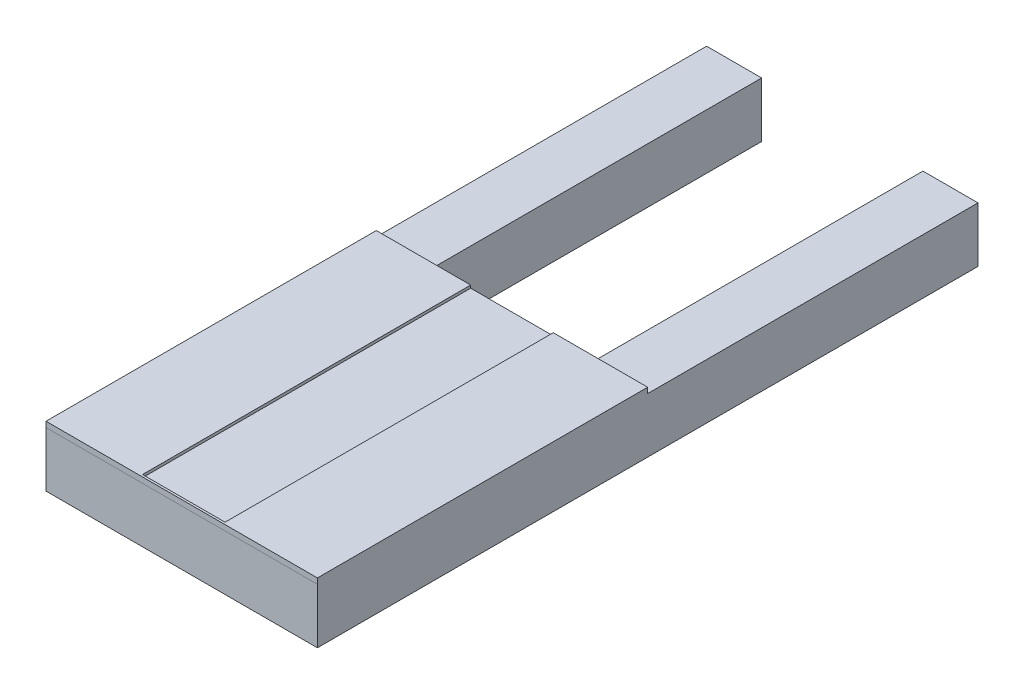
ISO-10303-21;
HEADER;
FILE_DESCRIPTION(('STEP AP214'),'2;1');
FILE_NAME('part.step','',(''),(''),'','','');
FILE_SCHEMA(('AUTOMOTIVE_DESIGN { 1 0 10303 214 1 1 1 1 }'));
ENDSEC;
DATA;
#1=APPLICATION_CONTEXT('core data for automotive mechanical design processes');
#2=APPLICATION_PROTOCOL_DEFINITION('international standard','automotive_design',2000,#1);
#3=PRODUCT_CONTEXT('',#1,'mechanical');
#4=PRODUCT('Part','Part','',(#3));
#5=PRODUCT_RELATED_PRODUCT_CATEGORY('part','',(#4));
#6=PRODUCT_DEFINITION_FORMATION('','',#4);
#7=PRODUCT_DEFINITION_CONTEXT('part definition',#1,'design');
#8=PRODUCT_DEFINITION('design','',#6,#7);
#9=PRODUCT_DEFINITION_SHAPE('','',#8);
#10=(LENGTH_UNIT() NAMED_UNIT(*) SI_UNIT(.MILLI.,.METRE.));
#11=(NAMED_UNIT(*) PLANE_ANGLE_UNIT() SI_UNIT($,.RADIAN.));
#12=(NAMED_UNIT(*) SI_UNIT($,.STERADIAN.) SOLID_ANGLE_UNIT());
#13=UNCERTAINTY_MEASURE_WITH_UNIT(LENGTH_MEASURE(1.E-05),#10,'distance_accuracy_value','');
#14=(GEOMETRIC_REPRESENTATION_CONTEXT(3) GLOBAL_UNCERTAINTY_ASSIGNED_CONTEXT((#13)) GLOBAL_UNIT_ASSIGNED_CONTEXT((#10,
#11,#12)) REPRESENTATION_CONTEXT('',''));
#15=CARTESIAN_POINT('',(0.,0.,0.));
#16=DIRECTION('',(0.,0.,1.));
#17=DIRECTION('',(1.,0.,0.));
#18=AXIS2_PLACEMENT_3D('',#15,#16,#17);
#19=CARTESIAN_POINT('',(0.,25.4,0.));
#20=DIRECTION('',(0.,-1.,0.));
#21=DIRECTION('',(0.,0.,-1.));
#22=AXIS2_PLACEMENT_3D('',#19,#20,#21);
#23=PLANE('',#22);
#24=DIRECTION('',(-1.,0.,0.));
#25=VECTOR('',#24,1.);
#26=CARTESIAN_POINT('',(-64.6545454545455,25.4,-105.48707431736));
#27=LINE('',#26,#25);
#28=CARTESIAN_POINT('',(60.5674545454546,25.4,-105.48707431736));
#29=VERTEX_POINT('',#28);
#30=CARTESIAN_POINT('',(35.1674545454546,25.4,-105.48707431736));
#31=VERTEX_POINT('',#30);
#32=EDGE_CURVE('E209',#29,#31,#27,.T.);
#33=ORIENTED_EDGE('',*,*,#32,.F.);
#34=DIRECTION('',(0.,0.,-1.));
#35=VECTOR('',#34,1.);
#36=CARTESIAN_POINT('',(60.5674545454546,25.4,-257.896590909091));
#37=LINE('',#36,#35);
#38=CARTESIAN_POINT('',(60.5674545454546,25.4,-257.896590909091));
#39=VERTEX_POINT('',#38);
#40=EDGE_CURVE('E247',#29,#39,#37,.T.);
#41=ORIENTED_EDGE('',*,*,#40,.T.);
#42=DIRECTION('',(-1.,0.,0.));
#43=VECTOR('',#42,1.);
#44=CARTESIAN_POINT('',(35.1674545454546,25.4,-257.896590909091));
#45=LINE('',#44,#43);
#46=CARTESIAN_POINT('',(35.1674545454546,25.4,-257.896590909091));
#47=VERTEX_POINT('',#46);
#48=EDGE_CURVE('E255',#39,#47,#45,.T.);
#49=ORIENTED_EDGE('',*,*,#48,.T.);
#50=DIRECTION('',(0.,0.,1.));
#51=VECTOR('',#50,1.);
#52=CARTESIAN_POINT('',(35.1674545454546,25.4,21.5034090909091));
#53=LINE('',#52,#51);
#54=EDGE_CURVE('E301',#47,#31,#53,.T.);
#55=ORIENTED_EDGE('',*,*,#54,.T.);
#56=EDGE_LOOP('',(#33,#41,#49,#55));
#57=FACE_BOUND('',#56,.T.);
#58=ADVANCED_FACE('F33',(#57),#23,.F.);
#59=CARTESIAN_POINT('',(-39.2545454545454,25.4,-105.48707431736));
#60=VERTEX_POINT('',#59);
#61=CARTESIAN_POINT('',(-64.6545454545455,25.4,-105.48707431736));
#62=VERTEX_POINT('',#61);
#63=EDGE_CURVE('E56',#60,#62,#27,.T.);
#64=ORIENTED_EDGE('',*,*,#63,.F.);
#65=DIRECTION('',(0.,0.,-1.));
#66=VECTOR('',#65,1.);
#67=CARTESIAN_POINT('',(-39.2545454545454,25.4,-257.896590909091));
#68=LINE('',#67,#66);
#69=CARTESIAN_POINT('',(-39.2545454545454,25.4,-257.896590909091));
#70=VERTEX_POINT('',#69);
#71=EDGE_CURVE('E298',#60,#70,#68,.T.);
#72=ORIENTED_EDGE('',*,*,#71,.T.);
#73=DIRECTION('',(-1.,0.,0.));
#74=VECTOR('',#73,1.);
#75=CARTESIAN_POINT('',(-64.6545454545454,25.4,-257.896590909091));
#76=LINE('',#75,#74);
#77=CARTESIAN_POINT('',(-64.6545454545454,25.4,-257.896590909091));
#78=VERTEX_POINT('',#77);
#79=EDGE_CURVE('E278',#70,#78,#76,.T.);
#80=ORIENTED_EDGE('',*,*,#79,.T.);
#81=DIRECTION('',(0.,0.,1.));
#82=VECTOR('',#81,1.);
#83=CARTESIAN_POINT('',(-64.6545454545454,25.4,46.9034090909092));
#84=LINE('',#83,#82);
#85=EDGE_CURVE('E248',#78,#62,#84,.T.);
#86=ORIENTED_EDGE('',*,*,#85,.T.);
#87=EDGE_LOOP('',(#64,#72,#80,#86));
#88=FACE_BOUND('',#87,.T.);
#89=ADVANCED_FACE('F348',(#88),#23,.F.);
#90=CARTESIAN_POINT('',(-64.6545454545454,25.4,46.9034090909092));
#91=DIRECTION('',(1.,0.,0.));
#92=DIRECTION('',(0.,0.,-1.));
#93=AXIS2_PLACEMENT_3D('',#90,#91,#92);
#94=PLANE('',#93);
#95=DIRECTION('',(0.,0.,1.));
#96=VECTOR('',#95,1.);
#97=CARTESIAN_POINT('',(-64.6545454545454,0.,46.9034090909092));
#98=LINE('',#97,#96);
#99=CARTESIAN_POINT('',(-64.6545454545454,0.,-257.896590909091));
#100=VERTEX_POINT('',#99);
#101=CARTESIAN_POINT('',(-64.6545454545454,0.,46.9034090909092));
#102=VERTEX_POINT('',#101);
#103=EDGE_CURVE('E233',#100,#102,#98,.T.);
#104=ORIENTED_EDGE('',*,*,#103,.T.);
#105=DIRECTION('',(0.,-1.,0.));
#106=VECTOR('',#105,1.);
#107=CARTESIAN_POINT('',(-64.6545454545454,25.4,46.9034090909092));
#108=LINE('',#107,#106);
#109=CARTESIAN_POINT('',(-64.6545454545454,25.4,46.9034090909092));
#110=VERTEX_POINT('',#109);
#111=EDGE_CURVE('E346',#110,#102,#108,.T.);
#112=ORIENTED_EDGE('',*,*,#111,.F.);
#113=DIRECTION('',(0.,0.,1.));
#114=VECTOR('',#113,1.);
#115=CARTESIAN_POINT('',(-64.6545454545455,25.4,-105.48707431736));
#116=LINE('',#115,#114);
#117=CARTESIAN_POINT('',(-64.6545454545454,25.4,46.9129256826401));
#118=VERTEX_POINT('',#117);
#119=EDGE_CURVE('E207',#110,#118,#116,.T.);
#120=ORIENTED_EDGE('',*,*,#119,.T.);
#121=DIRECTION('',(0.,-1.,0.));
#122=VECTOR('',#121,1.);
#123=CARTESIAN_POINT('',(-64.6545454545454,27.94,46.9129256826401));
#124=LINE('',#123,#122);
#125=CARTESIAN_POINT('',(-64.6545454545454,27.94,46.9129256826401));
#126=VERTEX_POINT('',#125);
#127=EDGE_CURVE('E205',#126,#118,#124,.T.);
#128=ORIENTED_EDGE('',*,*,#127,.F.);
#129=DIRECTION('',(0.,0.,1.));
#130=VECTOR('',#129,1.);
#131=CARTESIAN_POINT('',(-64.6545454545455,27.94,-105.48707431736));
#132=LINE('',#131,#130);
#133=CARTESIAN_POINT('',(-64.6545454545455,27.94,-105.48707431736));
#134=VERTEX_POINT('',#133);
#135=EDGE_CURVE('E191',#134,#126,#132,.T.);
#136=ORIENTED_EDGE('',*,*,#135,.F.);
#137=DIRECTION('',(0.,-1.,0.));
#138=VECTOR('',#137,1.);
#139=CARTESIAN_POINT('',(-64.6545454545455,27.94,-105.48707431736));
#140=LINE('',#139,#138);
#141=EDGE_CURVE('E220',#134,#62,#140,.T.);
#142=ORIENTED_EDGE('',*,*,#141,.T.);
#143=ORIENTED_EDGE('',*,*,#85,.F.);
#144=DIRECTION('',(0.,-1.,0.));
#145=VECTOR('',#144,1.);
#146=CARTESIAN_POINT('',(-64.6545454545454,25.4,-257.896590909091));
#147=LINE('',#146,#145);
#148=EDGE_CURVE('E275',#78,#100,#147,.T.);
#149=ORIENTED_EDGE('',*,*,#148,.T.);
#150=EDGE_LOOP('',(#104,#112,#120,#128,#136,#142,#143,#149));
#151=FACE_BOUND('',#150,.T.);
#152=ADVANCED_FACE('F35',(#151),#94,.F.);
#153=CARTESIAN_POINT('',(60.5674545454546,25.4,46.9034090909091));
#154=DIRECTION('',(0.,0.,-1.));
#155=DIRECTION('',(-1.,0.,0.));
#156=AXIS2_PLACEMENT_3D('',#153,#154,#155);
#157=PLANE('',#156);
#158=DIRECTION('',(1.,0.,0.));
#159=VECTOR('',#158,1.);
#160=CARTESIAN_POINT('',(60.5674545454546,0.,46.9034090909091));
#161=LINE('',#160,#159);
#162=CARTESIAN_POINT('',(60.5674545454546,0.,46.9034090909091));
#163=VERTEX_POINT('',#162);
#164=EDGE_CURVE('E290',#102,#163,#161,.T.);
#165=ORIENTED_EDGE('',*,*,#164,.T.);
#166=DIRECTION('',(0.,-1.,0.));
#167=VECTOR('',#166,1.);
#168=CARTESIAN_POINT('',(60.5674545454546,25.4,46.9034090909091));
#169=LINE('',#168,#167);
#170=CARTESIAN_POINT('',(60.5674545454546,25.4,46.9034090909091));
#171=VERTEX_POINT('',#170);
#172=EDGE_CURVE('E249',#171,#163,#169,.T.);
#173=ORIENTED_EDGE('',*,*,#172,.F.);
#174=DIRECTION('',(1.,0.,0.));
#175=VECTOR('',#174,1.);
#176=CARTESIAN_POINT('',(60.5674545454546,25.4,46.9034090909091));
#177=LINE('',#176,#175);
#178=EDGE_CURVE('E244',#110,#171,#177,.T.);
#179=ORIENTED_EDGE('',*,*,#178,.F.);
#180=ORIENTED_EDGE('',*,*,#111,.T.);
#181=EDGE_LOOP('',(#165,#173,#179,#180));
#182=FACE_BOUND('',#181,.T.);
#183=ADVANCED_FACE('F355',(#182),#157,.F.);
#184=CARTESIAN_POINT('',(60.5674545454546,25.4,-257.896590909091));
#185=DIRECTION('',(-1.,0.,0.));
#186=DIRECTION('',(0.,0.,1.));
#187=AXIS2_PLACEMENT_3D('',#184,#185,#186);
#188=PLANE('',#187);
#189=DIRECTION('',(0.,0.,-1.));
#190=VECTOR('',#189,1.);
#191=CARTESIAN_POINT('',(60.5674545454546,0.,-257.896590909091));
#192=LINE('',#191,#190);
#193=CARTESIAN_POINT('',(60.5674545454546,0.,-257.896590909091));
#194=VERTEX_POINT('',#193);
#195=EDGE_CURVE('E288',#163,#194,#192,.T.);
#196=ORIENTED_EDGE('',*,*,#195,.T.);
#197=DIRECTION('',(0.,-1.,0.));
#198=VECTOR('',#197,1.);
#199=CARTESIAN_POINT('',(60.5674545454546,25.4,-257.896590909091));
#200=LINE('',#199,#198);
#201=EDGE_CURVE('E260',#39,#194,#200,.T.);
#202=ORIENTED_EDGE('',*,*,#201,.F.);
#203=ORIENTED_EDGE('',*,*,#40,.F.);
#204=DIRECTION('',(0.,-1.,0.));
#205=VECTOR('',#204,1.);
#206=CARTESIAN_POINT('',(60.5674545454546,27.94,-105.48707431736));
#207=LINE('',#206,#205);
#208=CARTESIAN_POINT('',(60.5674545454546,27.94,-105.48707431736));
#209=VERTEX_POINT('',#208);
#210=EDGE_CURVE('E226',#209,#29,#207,.T.);
#211=ORIENTED_EDGE('',*,*,#210,.F.);
#212=DIRECTION('',(0.,0.,-1.));
#213=VECTOR('',#212,1.);
#214=CARTESIAN_POINT('',(60.5674545454546,27.94,-105.48707431736));
#215=LINE('',#214,#213);
#216=CARTESIAN_POINT('',(60.5674545454546,27.94,46.9129256826401));
#217=VERTEX_POINT('',#216);
#218=EDGE_CURVE('E183',#217,#209,#215,.T.);
#219=ORIENTED_EDGE('',*,*,#218,.F.);
#220=DIRECTION('',(0.,-1.,0.));
#221=VECTOR('',#220,1.);
#222=CARTESIAN_POINT('',(60.5674545454546,27.94,46.9129256826401));
#223=LINE('',#222,#221);
#224=CARTESIAN_POINT('',(60.5674545454546,25.4,46.9129256826401));
#225=VERTEX_POINT('',#224);
#226=EDGE_CURVE('E195',#217,#225,#223,.T.);
#227=ORIENTED_EDGE('',*,*,#226,.T.);
#228=DIRECTION('',(0.,0.,-1.));
#229=VECTOR('',#228,1.);
#230=CARTESIAN_POINT('',(60.5674545454546,25.4,-105.48707431736));
#231=LINE('',#230,#229);
#232=EDGE_CURVE('E182',#225,#171,#231,.T.);
#233=ORIENTED_EDGE('',*,*,#232,.T.);
#234=ORIENTED_EDGE('',*,*,#172,.T.);
#235=EDGE_LOOP('',(#196,#202,#203,#211,#219,#227,#233,#234));
#236=FACE_BOUND('',#235,.T.);
#237=ADVANCED_FACE('F330',(#236),#188,.F.);
#238=CARTESIAN_POINT('',(35.1674545454546,25.4,-257.896590909091));
#239=DIRECTION('',(0.,0.,1.));
#240=DIRECTION('',(1.,0.,0.));
#241=AXIS2_PLACEMENT_3D('',#238,#239,#240);
#242=PLANE('',#241);
#243=DIRECTION('',(-1.,0.,0.));
#244=VECTOR('',#243,1.);
#245=CARTESIAN_POINT('',(35.1674545454546,0.,-257.896590909091));
#246=LINE('',#245,#244);
#247=CARTESIAN_POINT('',(35.1674545454546,0.,-257.896590909091));
#248=VERTEX_POINT('',#247);
#249=EDGE_CURVE('E286',#194,#248,#246,.T.);
#250=ORIENTED_EDGE('',*,*,#249,.T.);
#251=DIRECTION('',(0.,-1.,0.));
#252=VECTOR('',#251,1.);
#253=CARTESIAN_POINT('',(35.1674545454546,25.4,-257.896590909091));
#254=LINE('',#253,#252);
#255=EDGE_CURVE('E263',#47,#248,#254,.T.);
#256=ORIENTED_EDGE('',*,*,#255,.F.);
#257=ORIENTED_EDGE('',*,*,#48,.F.);
#258=ORIENTED_EDGE('',*,*,#201,.T.);
#259=EDGE_LOOP('',(#250,#256,#257,#258));
#260=FACE_BOUND('',#259,.T.);
#261=ADVANCED_FACE('F314',(#260),#242,.F.);
#262=CARTESIAN_POINT('',(35.1674545454546,25.4,21.5034090909091));
#263=DIRECTION('',(1.,0.,0.));
#264=DIRECTION('',(0.,0.,-1.));
#265=AXIS2_PLACEMENT_3D('',#262,#263,#264);
#266=PLANE('',#265);
#267=DIRECTION('',(0.,0.,1.));
#268=VECTOR('',#267,1.);
#269=CARTESIAN_POINT('',(35.1674545454546,0.,21.5034090909091));
#270=LINE('',#269,#268);
#271=CARTESIAN_POINT('',(35.1674545454546,0.,21.5034090909091));
#272=VERTEX_POINT('',#271);
#273=EDGE_CURVE('E284',#248,#272,#270,.T.);
#274=ORIENTED_EDGE('',*,*,#273,.T.);
#275=DIRECTION('',(0.,-1.,0.));
#276=VECTOR('',#275,1.);
#277=CARTESIAN_POINT('',(35.1674545454546,25.4,21.5034090909091));
#278=LINE('',#277,#276);
#279=CARTESIAN_POINT('',(35.1674545454546,25.4,21.5034090909091));
#280=VERTEX_POINT('',#279);
#281=EDGE_CURVE('E266',#280,#272,#278,.T.);
#282=ORIENTED_EDGE('',*,*,#281,.F.);
#283=EDGE_CURVE('E303',#31,#280,#53,.T.);
#284=ORIENTED_EDGE('',*,*,#283,.F.);
#285=ORIENTED_EDGE('',*,*,#54,.F.);
#286=ORIENTED_EDGE('',*,*,#255,.T.);
#287=EDGE_LOOP('',(#274,#282,#284,#285,#286));
#288=FACE_BOUND('',#287,.T.);
#289=ADVANCED_FACE('F318',(#288),#266,.F.);
#290=CARTESIAN_POINT('',(-39.2545454545454,25.4,21.5034090909091));
#291=DIRECTION('',(0.,0.,1.));
#292=DIRECTION('',(1.,0.,0.));
#293=AXIS2_PLACEMENT_3D('',#290,#291,#292);
#294=PLANE('',#293);
#295=DIRECTION('',(-1.,0.,0.));
#296=VECTOR('',#295,1.);
#297=CARTESIAN_POINT('',(-39.2545454545454,0.,21.5034090909091));
#298=LINE('',#297,#296);
#299=CARTESIAN_POINT('',(-39.2545454545454,0.,21.5034090909091));
#300=VERTEX_POINT('',#299);
#301=EDGE_CURVE('E282',#272,#300,#298,.T.);
#302=ORIENTED_EDGE('',*,*,#301,.T.);
#303=DIRECTION('',(0.,-1.,0.));
#304=VECTOR('',#303,1.);
#305=CARTESIAN_POINT('',(-39.2545454545454,25.4,21.5034090909091));
#306=LINE('',#305,#304);
#307=CARTESIAN_POINT('',(-39.2545454545454,25.4,21.5034090909091));
#308=VERTEX_POINT('',#307);
#309=EDGE_CURVE('E269',#308,#300,#306,.T.);
#310=ORIENTED_EDGE('',*,*,#309,.F.);
#311=DIRECTION('',(-1.,0.,0.));
#312=VECTOR('',#311,1.);
#313=CARTESIAN_POINT('',(-39.2545454545454,25.4,21.5034090909091));
#314=LINE('',#313,#312);
#315=EDGE_CURVE('E299',#280,#308,#314,.T.);
#316=ORIENTED_EDGE('',*,*,#315,.F.);
#317=ORIENTED_EDGE('',*,*,#281,.T.);
#318=EDGE_LOOP('',(#302,#310,#316,#317));
#319=FACE_BOUND('',#318,.T.);
#320=ADVANCED_FACE('F322',(#319),#294,.F.);
#321=CARTESIAN_POINT('',(-39.2545454545454,25.4,-257.896590909091));
#322=DIRECTION('',(-1.,0.,0.));
#323=DIRECTION('',(0.,0.,1.));
#324=AXIS2_PLACEMENT_3D('',#321,#322,#323);
#325=PLANE('',#324);
#326=DIRECTION('',(0.,0.,-1.));
#327=VECTOR('',#326,1.);
#328=CARTESIAN_POINT('',(-39.2545454545454,0.,-257.896590909091));
#329=LINE('',#328,#327);
#330=CARTESIAN_POINT('',(-39.2545454545454,0.,-257.896590909091));
#331=VERTEX_POINT('',#330);
#332=EDGE_CURVE('E280',#300,#331,#329,.T.);
#333=ORIENTED_EDGE('',*,*,#332,.T.);
#334=DIRECTION('',(0.,-1.,0.));
#335=VECTOR('',#334,1.);
#336=CARTESIAN_POINT('',(-39.2545454545454,25.4,-257.896590909091));
#337=LINE('',#336,#335);
#338=EDGE_CURVE('E272',#70,#331,#337,.T.);
#339=ORIENTED_EDGE('',*,*,#338,.F.);
#340=ORIENTED_EDGE('',*,*,#71,.F.);
#341=EDGE_CURVE('E295',#308,#60,#68,.T.);
#342=ORIENTED_EDGE('',*,*,#341,.F.);
#343=ORIENTED_EDGE('',*,*,#309,.T.);
#344=EDGE_LOOP('',(#333,#339,#340,#342,#343));
#345=FACE_BOUND('',#344,.T.);
#346=ADVANCED_FACE('F338',(#345),#325,.F.);
#347=CARTESIAN_POINT('',(-64.6545454545454,25.4,-257.896590909091));
#348=DIRECTION('',(0.,0.,1.));
#349=DIRECTION('',(1.,0.,0.));
#350=AXIS2_PLACEMENT_3D('',#347,#348,#349);
#351=PLANE('',#350);
#352=DIRECTION('',(-1.,0.,0.));
#353=VECTOR('',#352,1.);
#354=CARTESIAN_POINT('',(-64.6545454545454,0.,-257.896590909091));
#355=LINE('',#354,#353);
#356=EDGE_CURVE('E259',#331,#100,#355,.T.);
#357=ORIENTED_EDGE('',*,*,#356,.T.);
#358=ORIENTED_EDGE('',*,*,#148,.F.);
#359=ORIENTED_EDGE('',*,*,#79,.F.);
#360=ORIENTED_EDGE('',*,*,#338,.T.);
#361=EDGE_LOOP('',(#357,#358,#359,#360));
#362=FACE_BOUND('',#361,.T.);
#363=ADVANCED_FACE('F342',(#362),#351,.F.);
#364=CARTESIAN_POINT('',(0.,0.,0.));
#365=DIRECTION('',(0.,-1.,0.));
#366=DIRECTION('',(0.,0.,-1.));
#367=AXIS2_PLACEMENT_3D('',#364,#365,#366);
#368=PLANE('',#367);
#369=ORIENTED_EDGE('',*,*,#103,.F.);
#370=ORIENTED_EDGE('',*,*,#356,.F.);
#371=ORIENTED_EDGE('',*,*,#332,.F.);
#372=ORIENTED_EDGE('',*,*,#301,.F.);
#373=ORIENTED_EDGE('',*,*,#273,.F.);
#374=ORIENTED_EDGE('',*,*,#249,.F.);
#375=ORIENTED_EDGE('',*,*,#195,.F.);
#376=ORIENTED_EDGE('',*,*,#164,.F.);
#377=EDGE_LOOP('',(#369,#370,#371,#372,#373,#374,#375,#376));
#378=FACE_BOUND('',#377,.T.);
#379=ADVANCED_FACE('F335',(#378),#368,.T.);
#380=CARTESIAN_POINT('',(0.,25.4,0.));
#381=DIRECTION('',(0.,1.,0.));
#382=DIRECTION('',(0.,0.,1.));
#383=AXIS2_PLACEMENT_3D('',#380,#381,#382);
#384=PLANE('',#383);
#385=ORIENTED_EDGE('',*,*,#119,.F.);
#386=ORIENTED_EDGE('',*,*,#178,.T.);
#387=ORIENTED_EDGE('',*,*,#232,.F.);
#388=DIRECTION('',(1.,0.,0.));
#389=VECTOR('',#388,1.);
#390=CARTESIAN_POINT('',(-64.6545454545454,25.4,46.9129256826401));
#391=LINE('',#390,#389);
#392=EDGE_CURVE('E187',#118,#225,#391,.T.);
#393=ORIENTED_EDGE('',*,*,#392,.F.);
#394=EDGE_LOOP('',(#385,#386,#387,#393));
#395=FACE_BOUND('',#394,.T.);
#396=ADVANCED_FACE('F361',(#395),#384,.F.);
#397=EDGE_CURVE('E198',#31,#60,#27,.T.);
#398=ORIENTED_EDGE('',*,*,#397,.F.);
#399=ORIENTED_EDGE('',*,*,#283,.T.);
#400=ORIENTED_EDGE('',*,*,#315,.T.);
#401=ORIENTED_EDGE('',*,*,#341,.T.);
#402=EDGE_LOOP('',(#398,#399,#400,#401));
#403=FACE_BOUND('',#402,.T.);
#404=ADVANCED_FACE('F324',(#403),#384,.F.);
#405=CARTESIAN_POINT('',(-64.6545454545455,27.94,-105.48707431736));
#406=DIRECTION('',(0.,0.,1.));
#407=DIRECTION('',(1.,0.,0.));
#408=AXIS2_PLACEMENT_3D('',#405,#406,#407);
#409=PLANE('',#408);
#410=DIRECTION('',(-1.,0.,0.));
#411=VECTOR('',#410,1.);
#412=CARTESIAN_POINT('',(-64.6545454545455,26.67,-105.48707431736));
#413=LINE('',#412,#411);
#414=CARTESIAN_POINT('',(17.0064545454546,26.67,-105.48707431736));
#415=VERTEX_POINT('',#414);
#416=CARTESIAN_POINT('',(-21.0935454545454,26.67,-105.48707431736));
#417=VERTEX_POINT('',#416);
#418=EDGE_CURVE('E11',#415,#417,#413,.T.);
#419=ORIENTED_EDGE('',*,*,#418,.F.);
#420=DIRECTION('',(0.,1.,0.));
#421=VECTOR('',#420,1.);
#422=CARTESIAN_POINT('',(17.0064545454546,27.94,-105.48707431736));
#423=LINE('',#422,#421);
#424=CARTESIAN_POINT('',(17.0064545454546,27.94,-105.48707431736));
#425=VERTEX_POINT('',#424);
#426=EDGE_CURVE('E179',#415,#425,#423,.T.);
#427=ORIENTED_EDGE('',*,*,#426,.T.);
#428=DIRECTION('',(-1.,0.,0.));
#429=VECTOR('',#428,1.);
#430=CARTESIAN_POINT('',(-64.6545454545455,27.94,-105.48707431736));
#431=LINE('',#430,#429);
#432=EDGE_CURVE('E188',#209,#425,#431,.T.);
#433=ORIENTED_EDGE('',*,*,#432,.F.);
#434=ORIENTED_EDGE('',*,*,#210,.T.);
#435=ORIENTED_EDGE('',*,*,#32,.T.);
#436=ORIENTED_EDGE('',*,*,#397,.T.);
#437=ORIENTED_EDGE('',*,*,#63,.T.);
#438=ORIENTED_EDGE('',*,*,#141,.F.);
#439=CARTESIAN_POINT('',(-21.0935454545454,27.94,-105.48707431736));
#440=VERTEX_POINT('',#439);
#441=EDGE_CURVE('E186',#440,#134,#431,.T.);
#442=ORIENTED_EDGE('',*,*,#441,.F.);
#443=DIRECTION('',(0.,-1.,0.));
#444=VECTOR('',#443,1.);
#445=CARTESIAN_POINT('',(-21.0935454545454,27.94,-105.48707431736));
#446=LINE('',#445,#444);
#447=EDGE_CURVE('E48',#440,#417,#446,.T.);
#448=ORIENTED_EDGE('',*,*,#447,.T.);
#449=EDGE_LOOP('',(#419,#427,#433,#434,#435,#436,#437,#438,#442,#448));
#450=FACE_BOUND('',#449,.T.);
#451=ADVANCED_FACE('F328',(#450),#409,.F.);
#452=CARTESIAN_POINT('',(-64.6545454545454,27.94,46.9129256826401));
#453=DIRECTION('',(0.,0.,-1.));
#454=DIRECTION('',(-1.,0.,0.));
#455=AXIS2_PLACEMENT_3D('',#452,#453,#454);
#456=PLANE('',#455);
#457=ORIENTED_EDGE('',*,*,#392,.T.);
#458=ORIENTED_EDGE('',*,*,#226,.F.);
#459=DIRECTION('',(1.,0.,0.));
#460=VECTOR('',#459,1.);
#461=CARTESIAN_POINT('',(-64.6545454545454,27.94,46.9129256826401));
#462=LINE('',#461,#460);
#463=EDGE_CURVE('E193',#126,#217,#462,.T.);
#464=ORIENTED_EDGE('',*,*,#463,.F.);
#465=ORIENTED_EDGE('',*,*,#127,.T.);
#466=EDGE_LOOP('',(#457,#458,#464,#465));
#467=FACE_BOUND('',#466,.T.);
#468=ADVANCED_FACE('F382',(#467),#456,.F.);
#469=CARTESIAN_POINT('',(0.,27.94,0.));
#470=DIRECTION('',(0.,1.,0.));
#471=DIRECTION('',(0.,0.,1.));
#472=AXIS2_PLACEMENT_3D('',#469,#470,#471);
#473=PLANE('',#472);
#474=DIRECTION('',(0.,0.,-1.));
#475=VECTOR('',#474,1.);
#476=CARTESIAN_POINT('',(17.0064545454546,27.94,-106.459071769938));
#477=LINE('',#476,#475);
#478=CARTESIAN_POINT('',(17.0064545454546,27.94,45.9409282300621));
#479=VERTEX_POINT('',#478);
#480=EDGE_CURVE('E173',#479,#425,#477,.T.);
#481=ORIENTED_EDGE('',*,*,#480,.F.);
#482=DIRECTION('',(1.,0.,0.));
#483=VECTOR('',#482,1.);
#484=CARTESIAN_POINT('',(-21.0935454545454,27.94,45.9409282300621));
#485=LINE('',#484,#483);
#486=CARTESIAN_POINT('',(-21.0935454545454,27.94,45.9409282300621));
#487=VERTEX_POINT('',#486);
#488=EDGE_CURVE('E175',#487,#479,#485,.T.);
#489=ORIENTED_EDGE('',*,*,#488,.F.);
#490=DIRECTION('',(0.,0.,1.));
#491=VECTOR('',#490,1.);
#492=CARTESIAN_POINT('',(-21.0935454545454,27.94,0.));
#493=LINE('',#492,#491);
#494=EDGE_CURVE('E41',#440,#487,#493,.T.);
#495=ORIENTED_EDGE('',*,*,#494,.F.);
#496=ORIENTED_EDGE('',*,*,#441,.T.);
#497=ORIENTED_EDGE('',*,*,#135,.T.);
#498=ORIENTED_EDGE('',*,*,#463,.T.);
#499=ORIENTED_EDGE('',*,*,#218,.T.);
#500=ORIENTED_EDGE('',*,*,#432,.T.);
#501=EDGE_LOOP('',(#481,#489,#495,#496,#497,#498,#499,#500));
#502=FACE_BOUND('',#501,.T.);
#503=ADVANCED_FACE('F385',(#502),#473,.T.);
#504=CARTESIAN_POINT('',(0.,26.67,0.));
#505=DIRECTION('',(0.,1.,0.));
#506=DIRECTION('',(0.,0.,1.));
#507=AXIS2_PLACEMENT_3D('',#504,#505,#506);
#508=PLANE('',#507);
#509=ORIENTED_EDGE('',*,*,#418,.T.);
#510=DIRECTION('',(0.,0.,1.));
#511=VECTOR('',#510,1.);
#512=CARTESIAN_POINT('',(-21.0935454545454,26.67,-106.459071769938));
#513=LINE('',#512,#511);
#514=CARTESIAN_POINT('',(-21.0935454545454,26.67,45.9409282300621));
#515=VERTEX_POINT('',#514);
#516=EDGE_CURVE('E151',#417,#515,#513,.T.);
#517=ORIENTED_EDGE('',*,*,#516,.T.);
#518=DIRECTION('',(1.,0.,0.));
#519=VECTOR('',#518,1.);
#520=CARTESIAN_POINT('',(-21.0935454545454,26.67,45.9409282300621));
#521=LINE('',#520,#519);
#522=CARTESIAN_POINT('',(17.0064545454546,26.67,45.9409282300621));
#523=VERTEX_POINT('',#522);
#524=EDGE_CURVE('E156',#515,#523,#521,.T.);
#525=ORIENTED_EDGE('',*,*,#524,.T.);
#526=DIRECTION('',(0.,0.,-1.));
#527=VECTOR('',#526,1.);
#528=CARTESIAN_POINT('',(17.0064545454546,26.67,-106.459071769938));
#529=LINE('',#528,#527);
#530=EDGE_CURVE('E158',#523,#415,#529,.T.);
#531=ORIENTED_EDGE('',*,*,#530,.T.);
#532=EDGE_LOOP('',(#509,#517,#525,#531));
#533=FACE_BOUND('',#532,.T.);
#534=ADVANCED_FACE('F153',(#533),#508,.T.);
#535=CARTESIAN_POINT('',(17.0064545454546,26.67,-106.459071769938));
#536=DIRECTION('',(1.,0.,0.));
#537=DIRECTION('',(0.,0.,-1.));
#538=AXIS2_PLACEMENT_3D('',#535,#536,#537);
#539=PLANE('',#538);
#540=ORIENTED_EDGE('',*,*,#530,.F.);
#541=DIRECTION('',(0.,1.,0.));
#542=VECTOR('',#541,1.);
#543=CARTESIAN_POINT('',(17.0064545454546,26.67,45.9409282300621));
#544=LINE('',#543,#542);
#545=EDGE_CURVE('E166',#523,#479,#544,.T.);
#546=ORIENTED_EDGE('',*,*,#545,.T.);
#547=ORIENTED_EDGE('',*,*,#480,.T.);
#548=ORIENTED_EDGE('',*,*,#426,.F.);
#549=EDGE_LOOP('',(#540,#546,#547,#548));
#550=FACE_BOUND('',#549,.T.);
#551=ADVANCED_FACE('F388',(#550),#539,.F.);
#552=CARTESIAN_POINT('',(-21.0935454545454,26.67,-106.459071769938));
#553=DIRECTION('',(-1.,0.,0.));
#554=DIRECTION('',(0.,0.,1.));
#555=AXIS2_PLACEMENT_3D('',#552,#553,#554);
#556=PLANE('',#555);
#557=ORIENTED_EDGE('',*,*,#494,.T.);
#558=DIRECTION('',(0.,1.,0.));
#559=VECTOR('',#558,1.);
#560=CARTESIAN_POINT('',(-21.0935454545454,26.67,45.9409282300621));
#561=LINE('',#560,#559);
#562=EDGE_CURVE('E161',#515,#487,#561,.T.);
#563=ORIENTED_EDGE('',*,*,#562,.F.);
#564=ORIENTED_EDGE('',*,*,#516,.F.);
#565=ORIENTED_EDGE('',*,*,#447,.F.);
#566=EDGE_LOOP('',(#557,#563,#564,#565));
#567=FACE_BOUND('',#566,.T.);
#568=ADVANCED_FACE('F162',(#567),#556,.F.);
#569=CARTESIAN_POINT('',(-21.0935454545454,26.67,45.9409282300621));
#570=DIRECTION('',(0.,0.,1.));
#571=DIRECTION('',(1.,0.,0.));
#572=AXIS2_PLACEMENT_3D('',#569,#570,#571);
#573=PLANE('',#572);
#574=ORIENTED_EDGE('',*,*,#488,.T.);
#575=ORIENTED_EDGE('',*,*,#545,.F.);
#576=ORIENTED_EDGE('',*,*,#524,.F.);
#577=ORIENTED_EDGE('',*,*,#562,.T.);
#578=EDGE_LOOP('',(#574,#575,#576,#577));
#579=FACE_BOUND('',#578,.T.);
#580=ADVANCED_FACE('F168',(#579),#573,.F.);
#581=CLOSED_SHELL('',(#58,#89,#152,#183,#237,#261,#289,#320,#346,#363,#379,#396,#404,#451,#468,
#503,#534,#551,#568,#580));
#582=MANIFOLD_SOLID_BREP('B2',#581);
#583=ADVANCED_BREP_SHAPE_REPRESENTATION('',(#18,#582),#14);
#584=SHAPE_DEFINITION_REPRESENTATION(#9,#583);
ENDSEC;
END-ISO-10303-21;
